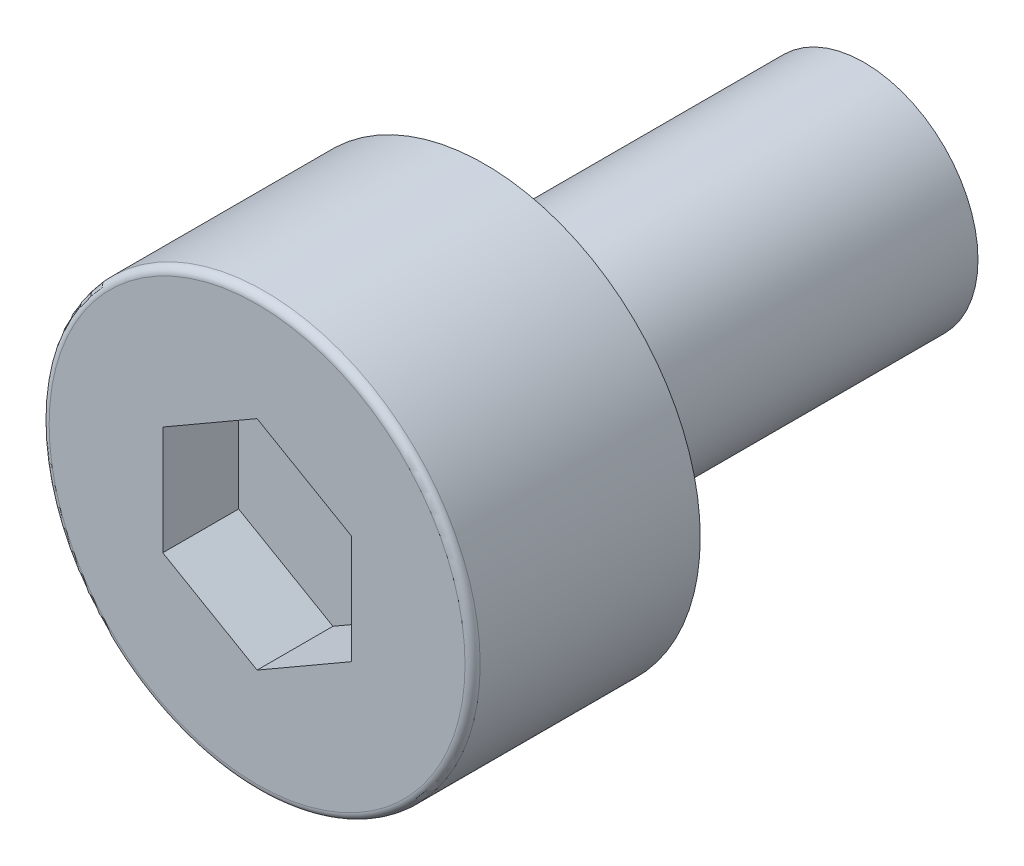
ISO-10303-21;
HEADER;
FILE_DESCRIPTION(('STEP AP214'),'2;1');
FILE_NAME('part.step','',(''),(''),'','','');
FILE_SCHEMA(('AUTOMOTIVE_DESIGN { 1 0 10303 214 1 1 1 1 }'));
ENDSEC;
DATA;
#1=APPLICATION_CONTEXT('core data for automotive mechanical design processes');
#2=APPLICATION_PROTOCOL_DEFINITION('international standard','automotive_design',2000,#1);
#3=PRODUCT_CONTEXT('',#1,'mechanical');
#4=PRODUCT('Part','Part','',(#3));
#5=PRODUCT_RELATED_PRODUCT_CATEGORY('part','',(#4));
#6=PRODUCT_DEFINITION_FORMATION('','',#4);
#7=PRODUCT_DEFINITION_CONTEXT('part definition',#1,'design');
#8=PRODUCT_DEFINITION('design','',#6,#7);
#9=PRODUCT_DEFINITION_SHAPE('','',#8);
#10=(LENGTH_UNIT() NAMED_UNIT(*) SI_UNIT(.MILLI.,.METRE.));
#11=(NAMED_UNIT(*) PLANE_ANGLE_UNIT() SI_UNIT($,.RADIAN.));
#12=(NAMED_UNIT(*) SI_UNIT($,.STERADIAN.) SOLID_ANGLE_UNIT());
#13=UNCERTAINTY_MEASURE_WITH_UNIT(LENGTH_MEASURE(1.E-05),#10,'distance_accuracy_value','');
#14=(GEOMETRIC_REPRESENTATION_CONTEXT(3) GLOBAL_UNCERTAINTY_ASSIGNED_CONTEXT((#13)) GLOBAL_UNIT_ASSIGNED_CONTEXT((#10,
#11,#12)) REPRESENTATION_CONTEXT('',''));
#15=CARTESIAN_POINT('',(0.,0.,0.));
#16=DIRECTION('',(0.,0.,1.));
#17=DIRECTION('',(1.,0.,0.));
#18=AXIS2_PLACEMENT_3D('',#15,#16,#17);
#19=CARTESIAN_POINT('',(0.,0.,2.));
#20=DIRECTION('',(0.,0.,1.));
#21=DIRECTION('',(1.,0.,0.));
#22=AXIS2_PLACEMENT_3D('',#19,#20,#21);
#23=PLANE('',#22);
#24=DIRECTION('',(-0.866025403784439,-0.5,0.));
#25=VECTOR('',#24,1.);
#26=CARTESIAN_POINT('',(0.,1.435,2.));
#27=LINE('',#26,#25);
#28=CARTESIAN_POINT('',(0.,1.435,2.));
#29=VERTEX_POINT('',#28);
#30=CARTESIAN_POINT('',(-1.24274645443067,0.7175,2.));
#31=VERTEX_POINT('',#30);
#32=EDGE_CURVE('E60',#29,#31,#27,.T.);
#33=ORIENTED_EDGE('',*,*,#32,.T.);
#34=DIRECTION('',(0.,-1.,0.));
#35=VECTOR('',#34,1.);
#36=CARTESIAN_POINT('',(-1.24274645443067,0.7175,2.));
#37=LINE('',#36,#35);
#38=CARTESIAN_POINT('',(-1.24274645443067,-0.7175,2.));
#39=VERTEX_POINT('',#38);
#40=EDGE_CURVE('E62',#31,#39,#37,.T.);
#41=ORIENTED_EDGE('',*,*,#40,.T.);
#42=DIRECTION('',(0.866025403784439,-0.5,0.));
#43=VECTOR('',#42,1.);
#44=CARTESIAN_POINT('',(-1.24274645443067,-0.7175,2.));
#45=LINE('',#44,#43);
#46=CARTESIAN_POINT('',(0.,-1.435,2.));
#47=VERTEX_POINT('',#46);
#48=EDGE_CURVE('E64',#39,#47,#45,.T.);
#49=ORIENTED_EDGE('',*,*,#48,.T.);
#50=DIRECTION('',(0.866025403784439,0.5,0.));
#51=VECTOR('',#50,1.);
#52=CARTESIAN_POINT('',(0.,-1.435,2.));
#53=LINE('',#52,#51);
#54=CARTESIAN_POINT('',(1.24274645443067,-0.717500000000001,2.));
#55=VERTEX_POINT('',#54);
#56=EDGE_CURVE('E297',#47,#55,#53,.T.);
#57=ORIENTED_EDGE('',*,*,#56,.T.);
#58=DIRECTION('',(0.,1.,0.));
#59=VECTOR('',#58,1.);
#60=CARTESIAN_POINT('',(1.24274645443067,-0.7175,2.));
#61=LINE('',#60,#59);
#62=CARTESIAN_POINT('',(1.24274645443067,0.7175,2.));
#63=VERTEX_POINT('',#62);
#64=EDGE_CURVE('E292',#55,#63,#61,.T.);
#65=ORIENTED_EDGE('',*,*,#64,.T.);
#66=DIRECTION('',(-0.866025403784439,0.5,0.));
#67=VECTOR('',#66,1.);
#68=CARTESIAN_POINT('',(1.24274645443067,0.717500000000001,2.));
#69=LINE('',#68,#67);
#70=EDGE_CURVE('E287',#63,#29,#69,.T.);
#71=ORIENTED_EDGE('',*,*,#70,.T.);
#72=EDGE_LOOP('',(#33,#41,#49,#57,#65,#71));
#73=FACE_BOUND('',#72,.T.);
#74=ADVANCED_FACE('F17',(#73),#23,.T.);
#75=CARTESIAN_POINT('',(-1.24274645443067,-0.7175,2.));
#76=DIRECTION('',(-0.5,-0.866025403784439,0.));
#77=DIRECTION('',(0.866025403784439,-0.5,0.));
#78=AXIS2_PLACEMENT_3D('',#75,#76,#77);
#79=PLANE('',#78);
#80=DIRECTION('',(0.,0.,1.));
#81=VECTOR('',#80,1.);
#82=CARTESIAN_POINT('',(0.,-1.435,2.));
#83=LINE('',#82,#81);
#84=CARTESIAN_POINT('',(0.,-1.435,3.));
#85=VERTEX_POINT('',#84);
#86=EDGE_CURVE('E79',#85,#47,#83,.F.);
#87=ORIENTED_EDGE('',*,*,#86,.T.);
#88=ORIENTED_EDGE('',*,*,#48,.F.);
#89=DIRECTION('',(0.,0.,1.));
#90=VECTOR('',#89,1.);
#91=CARTESIAN_POINT('',(-1.24274645443067,-0.7175,2.));
#92=LINE('',#91,#90);
#93=CARTESIAN_POINT('',(-1.24274645443067,-0.7175,3.));
#94=VERTEX_POINT('',#93);
#95=EDGE_CURVE('E70',#39,#94,#92,.T.);
#96=ORIENTED_EDGE('',*,*,#95,.T.);
#97=DIRECTION('',(-0.866025403784438,0.5,0.));
#98=VECTOR('',#97,1.);
#99=CARTESIAN_POINT('',(0.,-1.435,3.));
#100=LINE('',#99,#98);
#101=EDGE_CURVE('E146',#85,#94,#100,.T.);
#102=ORIENTED_EDGE('',*,*,#101,.F.);
#103=EDGE_LOOP('',(#87,#88,#96,#102));
#104=FACE_BOUND('',#103,.T.);
#105=ADVANCED_FACE('F74',(#104),#79,.F.);
#106=CARTESIAN_POINT('',(-1.24274645443067,0.7175,2.));
#107=DIRECTION('',(-1.,0.,0.));
#108=DIRECTION('',(0.,-1.,0.));
#109=AXIS2_PLACEMENT_3D('',#106,#107,#108);
#110=PLANE('',#109);
#111=ORIENTED_EDGE('',*,*,#95,.F.);
#112=ORIENTED_EDGE('',*,*,#40,.F.);
#113=DIRECTION('',(0.,0.,1.));
#114=VECTOR('',#113,1.);
#115=CARTESIAN_POINT('',(-1.24274645443067,0.7175,2.));
#116=LINE('',#115,#114);
#117=CARTESIAN_POINT('',(-1.24274645443067,0.7175,3.));
#118=VERTEX_POINT('',#117);
#119=EDGE_CURVE('E87',#31,#118,#116,.T.);
#120=ORIENTED_EDGE('',*,*,#119,.T.);
#121=DIRECTION('',(0.,1.,0.));
#122=VECTOR('',#121,1.);
#123=CARTESIAN_POINT('',(-1.24274645443067,0.,3.));
#124=LINE('',#123,#122);
#125=EDGE_CURVE('E84',#94,#118,#124,.T.);
#126=ORIENTED_EDGE('',*,*,#125,.F.);
#127=EDGE_LOOP('',(#111,#112,#120,#126));
#128=FACE_BOUND('',#127,.T.);
#129=ADVANCED_FACE('F82',(#128),#110,.F.);
#130=CARTESIAN_POINT('',(0.,1.435,2.));
#131=DIRECTION('',(-0.5,0.866025403784439,0.));
#132=DIRECTION('',(-0.866025403784439,-0.5,0.));
#133=AXIS2_PLACEMENT_3D('',#130,#131,#132);
#134=PLANE('',#133);
#135=ORIENTED_EDGE('',*,*,#119,.F.);
#136=ORIENTED_EDGE('',*,*,#32,.F.);
#137=DIRECTION('',(0.,0.,1.));
#138=VECTOR('',#137,1.);
#139=CARTESIAN_POINT('',(0.,1.435,2.));
#140=LINE('',#139,#138);
#141=CARTESIAN_POINT('',(0.,1.435,3.));
#142=VERTEX_POINT('',#141);
#143=EDGE_CURVE('E288',#29,#142,#140,.T.);
#144=ORIENTED_EDGE('',*,*,#143,.T.);
#145=DIRECTION('',(0.866025403784439,0.5,0.));
#146=VECTOR('',#145,1.);
#147=CARTESIAN_POINT('',(-1.24274645443067,0.7175,3.));
#148=LINE('',#147,#146);
#149=EDGE_CURVE('E142',#118,#142,#148,.T.);
#150=ORIENTED_EDGE('',*,*,#149,.F.);
#151=EDGE_LOOP('',(#135,#136,#144,#150));
#152=FACE_BOUND('',#151,.T.);
#153=ADVANCED_FACE('F225',(#152),#134,.F.);
#154=CARTESIAN_POINT('',(1.24274645443067,0.717500000000001,2.));
#155=DIRECTION('',(0.5,0.866025403784439,0.));
#156=DIRECTION('',(-0.866025403784439,0.5,0.));
#157=AXIS2_PLACEMENT_3D('',#154,#155,#156);
#158=PLANE('',#157);
#159=ORIENTED_EDGE('',*,*,#143,.F.);
#160=ORIENTED_EDGE('',*,*,#70,.F.);
#161=DIRECTION('',(0.,0.,1.));
#162=VECTOR('',#161,1.);
#163=CARTESIAN_POINT('',(1.24274645443067,0.717500000000001,2.));
#164=LINE('',#163,#162);
#165=CARTESIAN_POINT('',(1.24274645443067,0.717500000000001,3.));
#166=VERTEX_POINT('',#165);
#167=EDGE_CURVE('E294',#63,#166,#164,.T.);
#168=ORIENTED_EDGE('',*,*,#167,.T.);
#169=DIRECTION('',(0.866025403784439,-0.5,0.));
#170=VECTOR('',#169,1.);
#171=CARTESIAN_POINT('',(0.,1.435,3.));
#172=LINE('',#171,#170);
#173=EDGE_CURVE('E139',#142,#166,#172,.T.);
#174=ORIENTED_EDGE('',*,*,#173,.F.);
#175=EDGE_LOOP('',(#159,#160,#168,#174));
#176=FACE_BOUND('',#175,.T.);
#177=ADVANCED_FACE('F217',(#176),#158,.F.);
#178=CARTESIAN_POINT('',(1.24274645443067,-0.7175,2.));
#179=DIRECTION('',(1.,0.,0.));
#180=DIRECTION('',(0.,1.,0.));
#181=AXIS2_PLACEMENT_3D('',#178,#179,#180);
#182=PLANE('',#181);
#183=ORIENTED_EDGE('',*,*,#167,.F.);
#184=ORIENTED_EDGE('',*,*,#64,.F.);
#185=DIRECTION('',(0.,0.,1.));
#186=VECTOR('',#185,1.);
#187=CARTESIAN_POINT('',(1.24274645443067,-0.717500000000001,2.));
#188=LINE('',#187,#186);
#189=CARTESIAN_POINT('',(1.24274645443067,-0.717500000000001,3.));
#190=VERTEX_POINT('',#189);
#191=EDGE_CURVE('E147',#55,#190,#188,.T.);
#192=ORIENTED_EDGE('',*,*,#191,.T.);
#193=DIRECTION('',(0.,1.,0.));
#194=VECTOR('',#193,1.);
#195=CARTESIAN_POINT('',(1.24274645443067,0.,3.));
#196=LINE('',#195,#194);
#197=EDGE_CURVE('E136',#166,#190,#196,.F.);
#198=ORIENTED_EDGE('',*,*,#197,.F.);
#199=EDGE_LOOP('',(#183,#184,#192,#198));
#200=FACE_BOUND('',#199,.T.);
#201=ADVANCED_FACE('F210',(#200),#182,.F.);
#202=CARTESIAN_POINT('',(0.,-1.435,2.));
#203=DIRECTION('',(0.5,-0.866025403784439,0.));
#204=DIRECTION('',(0.866025403784439,0.5,0.));
#205=AXIS2_PLACEMENT_3D('',#202,#203,#204);
#206=PLANE('',#205);
#207=ORIENTED_EDGE('',*,*,#191,.F.);
#208=ORIENTED_EDGE('',*,*,#56,.F.);
#209=ORIENTED_EDGE('',*,*,#86,.F.);
#210=DIRECTION('',(-0.866025403784439,-0.5,0.));
#211=VECTOR('',#210,1.);
#212=CARTESIAN_POINT('',(1.24274645443067,-0.7175,3.));
#213=LINE('',#212,#211);
#214=EDGE_CURVE('E97',#190,#85,#213,.T.);
#215=ORIENTED_EDGE('',*,*,#214,.F.);
#216=EDGE_LOOP('',(#207,#208,#209,#215));
#217=FACE_BOUND('',#216,.T.);
#218=ADVANCED_FACE('F203',(#217),#206,.F.);
#219=CARTESIAN_POINT('',(0.,0.,-5.));
#220=DIRECTION('',(0.,0.,-1.));
#221=DIRECTION('',(-1.,0.,0.));
#222=AXIS2_PLACEMENT_3D('',#219,#220,#221);
#223=PLANE('',#222);
#224=CARTESIAN_POINT('',(0.,0.,-5.));
#225=DIRECTION('',(0.,0.,1.));
#226=DIRECTION('',(1.,0.,0.));
#227=AXIS2_PLACEMENT_3D('',#224,#225,#226);
#228=CIRCLE('',#227,1.5);
#229=CARTESIAN_POINT('',(1.5,0.,-5.));
#230=VERTEX_POINT('',#229);
#231=EDGE_CURVE('E95',#230,#230,#228,.T.);
#232=ORIENTED_EDGE('',*,*,#231,.F.);
#233=EDGE_LOOP('',(#232));
#234=FACE_BOUND('',#233,.T.);
#235=ADVANCED_FACE('F122',(#234),#223,.T.);
#236=CARTESIAN_POINT('',(0.,0.,3.));
#237=DIRECTION('',(0.,0.,1.));
#238=DIRECTION('',(1.,0.,0.));
#239=AXIS2_PLACEMENT_3D('',#236,#237,#238);
#240=PLANE('',#239);
#241=ORIENTED_EDGE('',*,*,#197,.T.);
#242=ORIENTED_EDGE('',*,*,#214,.T.);
#243=ORIENTED_EDGE('',*,*,#101,.T.);
#244=ORIENTED_EDGE('',*,*,#125,.T.);
#245=ORIENTED_EDGE('',*,*,#149,.T.);
#246=ORIENTED_EDGE('',*,*,#173,.T.);
#247=EDGE_LOOP('',(#241,#242,#243,#244,#245,#246));
#248=FACE_BOUND('',#247,.T.);
#249=CARTESIAN_POINT('',(0.,0.,3.));
#250=DIRECTION('',(0.,0.,-1.));
#251=DIRECTION('',(-1.,0.,0.));
#252=AXIS2_PLACEMENT_3D('',#249,#250,#251);
#253=CIRCLE('',#252,2.74);
#254=CARTESIAN_POINT('',(-2.74,0.,3.));
#255=VERTEX_POINT('',#254);
#256=CARTESIAN_POINT('',(2.74,0.,3.));
#257=VERTEX_POINT('',#256);
#258=EDGE_CURVE('E94',#255,#257,#253,.T.);
#259=ORIENTED_EDGE('',*,*,#258,.F.);
#260=CARTESIAN_POINT('',(0.,0.,3.));
#261=DIRECTION('',(0.,0.,-1.));
#262=DIRECTION('',(1.,0.,0.));
#263=AXIS2_PLACEMENT_3D('',#260,#261,#262);
#264=CIRCLE('',#263,2.74);
#265=EDGE_CURVE('E36',#257,#255,#264,.T.);
#266=ORIENTED_EDGE('',*,*,#265,.F.);
#267=EDGE_LOOP('',(#259,#266));
#268=FACE_BOUND('',#267,.T.);
#269=ADVANCED_FACE('F103',(#248,#268),#240,.T.);
#270=CARTESIAN_POINT('',(0.,0.,-5.));
#271=DIRECTION('',(0.,0.,1.));
#272=DIRECTION('',(1.,0.,0.));
#273=AXIS2_PLACEMENT_3D('',#270,#271,#272);
#274=CYLINDRICAL_SURFACE('',#273,1.5);
#275=ORIENTED_EDGE('',*,*,#231,.T.);
#276=EDGE_LOOP('',(#275));
#277=FACE_BOUND('',#276,.T.);
#278=CARTESIAN_POINT('',(0.,0.,0.));
#279=DIRECTION('',(0.,0.,1.));
#280=DIRECTION('',(1.,0.,0.));
#281=AXIS2_PLACEMENT_3D('',#278,#279,#280);
#282=CIRCLE('',#281,1.5);
#283=CARTESIAN_POINT('',(1.5,0.,0.));
#284=VERTEX_POINT('',#283);
#285=EDGE_CURVE('E91',#284,#284,#282,.F.);
#286=ORIENTED_EDGE('',*,*,#285,.T.);
#287=EDGE_LOOP('',(#286));
#288=FACE_BOUND('',#287,.T.);
#289=ADVANCED_FACE('F121',(#277,#288),#274,.T.);
#290=CARTESIAN_POINT('',(0.,0.,2.9));
#291=DIRECTION('',(0.,0.,1.));
#292=DIRECTION('',(1.,0.,0.));
#293=AXIS2_PLACEMENT_3D('',#290,#291,#292);
#294=TOROIDAL_SURFACE('',#293,2.74,0.1);
#295=ORIENTED_EDGE('',*,*,#265,.T.);
#296=ORIENTED_EDGE('',*,*,#258,.T.);
#297=EDGE_LOOP('',(#295,#296));
#298=FACE_BOUND('',#297,.T.);
#299=CARTESIAN_POINT('',(0.,0.,2.9));
#300=DIRECTION('',(0.,0.,-1.));
#301=DIRECTION('',(-1.,0.,0.));
#302=AXIS2_PLACEMENT_3D('',#299,#300,#301);
#303=CIRCLE('',#302,2.84);
#304=CARTESIAN_POINT('',(-2.84,0.,2.9));
#305=VERTEX_POINT('',#304);
#306=EDGE_CURVE('E28',#305,#305,#303,.T.);
#307=ORIENTED_EDGE('',*,*,#306,.F.);
#308=EDGE_LOOP('',(#307));
#309=FACE_BOUND('',#308,.T.);
#310=ADVANCED_FACE('F99',(#298,#309),#294,.T.);
#311=CARTESIAN_POINT('',(0.,0.,0.));
#312=DIRECTION('',(0.,0.,1.));
#313=DIRECTION('',(1.,0.,0.));
#314=AXIS2_PLACEMENT_3D('',#311,#312,#313);
#315=PLANE('',#314);
#316=ORIENTED_EDGE('',*,*,#285,.F.);
#317=EDGE_LOOP('',(#316));
#318=FACE_BOUND('',#317,.T.);
#319=CARTESIAN_POINT('',(0.,0.,0.));
#320=DIRECTION('',(0.,0.,-1.));
#321=DIRECTION('',(-1.,0.,0.));
#322=AXIS2_PLACEMENT_3D('',#319,#320,#321);
#323=CIRCLE('',#322,2.84);
#324=CARTESIAN_POINT('',(-2.84,0.,0.));
#325=VERTEX_POINT('',#324);
#326=EDGE_CURVE('E11',#325,#325,#323,.F.);
#327=ORIENTED_EDGE('',*,*,#326,.F.);
#328=EDGE_LOOP('',(#327));
#329=FACE_BOUND('',#328,.T.);
#330=ADVANCED_FACE('F161',(#318,#329),#315,.F.);
#331=CARTESIAN_POINT('',(0.,0.,3.));
#332=DIRECTION('',(0.,0.,-1.));
#333=DIRECTION('',(-1.,0.,0.));
#334=AXIS2_PLACEMENT_3D('',#331,#332,#333);
#335=CYLINDRICAL_SURFACE('',#334,2.84);
#336=ORIENTED_EDGE('',*,*,#326,.T.);
#337=EDGE_LOOP('',(#336));
#338=FACE_BOUND('',#337,.T.);
#339=ORIENTED_EDGE('',*,*,#306,.T.);
#340=EDGE_LOOP('',(#339));
#341=FACE_BOUND('',#340,.T.);
#342=ADVANCED_FACE('F165',(#338,#341),#335,.T.);
#343=CLOSED_SHELL('',(#74,#105,#129,#153,#177,#201,#218,#235,#269,#289,#310,#330,#342));
#344=MANIFOLD_SOLID_BREP('B1',#343);
#345=ADVANCED_BREP_SHAPE_REPRESENTATION('',(#18,#344),#14);
#346=SHAPE_DEFINITION_REPRESENTATION(#9,#345);
ENDSEC;
END-ISO-10303-21;
